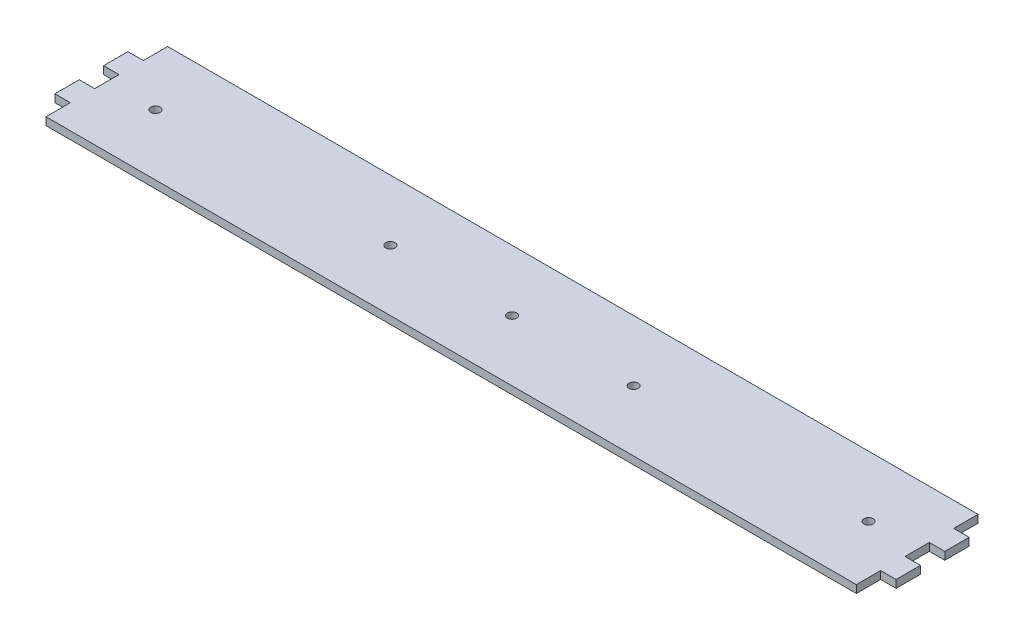
ISO-10303-21;
HEADER;
FILE_DESCRIPTION(('STEP AP214'),'2;1');
FILE_NAME('part.step','',(''),(''),'','','');
FILE_SCHEMA(('AUTOMOTIVE_DESIGN { 1 0 10303 214 1 1 1 1 }'));
ENDSEC;
DATA;
#1=APPLICATION_CONTEXT('core data for automotive mechanical design processes');
#2=APPLICATION_PROTOCOL_DEFINITION('international standard','automotive_design',2000,#1);
#3=PRODUCT_CONTEXT('',#1,'mechanical');
#4=PRODUCT('Part','Part','',(#3));
#5=PRODUCT_RELATED_PRODUCT_CATEGORY('part','',(#4));
#6=PRODUCT_DEFINITION_FORMATION('','',#4);
#7=PRODUCT_DEFINITION_CONTEXT('part definition',#1,'design');
#8=PRODUCT_DEFINITION('design','',#6,#7);
#9=PRODUCT_DEFINITION_SHAPE('','',#8);
#10=(LENGTH_UNIT() NAMED_UNIT(*) SI_UNIT(.MILLI.,.METRE.));
#11=(NAMED_UNIT(*) PLANE_ANGLE_UNIT() SI_UNIT($,.RADIAN.));
#12=(NAMED_UNIT(*) SI_UNIT($,.STERADIAN.) SOLID_ANGLE_UNIT());
#13=UNCERTAINTY_MEASURE_WITH_UNIT(LENGTH_MEASURE(1.E-05),#10,'distance_accuracy_value','');
#14=(GEOMETRIC_REPRESENTATION_CONTEXT(3) GLOBAL_UNCERTAINTY_ASSIGNED_CONTEXT((#13)) GLOBAL_UNIT_ASSIGNED_CONTEXT((#10,
#11,#12)) REPRESENTATION_CONTEXT('',''));
#15=CARTESIAN_POINT('',(0.,0.,0.));
#16=DIRECTION('',(0.,0.,1.));
#17=DIRECTION('',(1.,0.,0.));
#18=AXIS2_PLACEMENT_3D('',#15,#16,#17);
#19=CARTESIAN_POINT('',(0.,3.175,0.));
#20=DIRECTION('',(0.,-1.,0.));
#21=DIRECTION('',(0.,0.,-1.));
#22=AXIS2_PLACEMENT_3D('',#19,#20,#21);
#23=CYLINDRICAL_SURFACE('',#22,1.9);
#24=CARTESIAN_POINT('',(0.,3.175,0.));
#25=DIRECTION('',(0.,1.,0.));
#26=DIRECTION('',(0.,0.,1.));
#27=AXIS2_PLACEMENT_3D('',#24,#25,#26);
#28=CIRCLE('',#27,1.9);
#29=CARTESIAN_POINT('',(0.,3.175,1.89999999999998));
#30=VERTEX_POINT('',#29);
#31=EDGE_CURVE('E304',#30,#30,#28,.T.);
#32=ORIENTED_EDGE('',*,*,#31,.T.);
#33=EDGE_LOOP('',(#32));
#34=FACE_BOUND('',#33,.T.);
#35=CARTESIAN_POINT('',(0.,0.,0.));
#36=DIRECTION('',(0.,1.,0.));
#37=DIRECTION('',(0.,0.,1.));
#38=AXIS2_PLACEMENT_3D('',#35,#36,#37);
#39=CIRCLE('',#38,1.9);
#40=CARTESIAN_POINT('',(0.,0.,1.89999999999998));
#41=VERTEX_POINT('',#40);
#42=EDGE_CURVE('E353',#41,#41,#39,.T.);
#43=ORIENTED_EDGE('',*,*,#42,.F.);
#44=EDGE_LOOP('',(#43));
#45=FACE_BOUND('',#44,.T.);
#46=ADVANCED_FACE('F131',(#34,#45),#23,.F.);
#47=CARTESIAN_POINT('',(50.,3.175,0.));
#48=DIRECTION('',(0.,-1.,0.));
#49=DIRECTION('',(0.,0.,-1.));
#50=AXIS2_PLACEMENT_3D('',#47,#48,#49);
#51=CYLINDRICAL_SURFACE('',#50,1.9);
#52=CARTESIAN_POINT('',(50.,3.175,0.));
#53=DIRECTION('',(0.,1.,0.));
#54=DIRECTION('',(0.,0.,1.));
#55=AXIS2_PLACEMENT_3D('',#52,#53,#54);
#56=CIRCLE('',#55,1.9);
#57=CARTESIAN_POINT('',(50.,3.175,1.89999999999998));
#58=VERTEX_POINT('',#57);
#59=EDGE_CURVE('E308',#58,#58,#56,.T.);
#60=ORIENTED_EDGE('',*,*,#59,.T.);
#61=EDGE_LOOP('',(#60));
#62=FACE_BOUND('',#61,.T.);
#63=CARTESIAN_POINT('',(50.,0.,0.));
#64=DIRECTION('',(0.,1.,0.));
#65=DIRECTION('',(0.,0.,1.));
#66=AXIS2_PLACEMENT_3D('',#63,#64,#65);
#67=CIRCLE('',#66,1.9);
#68=CARTESIAN_POINT('',(50.,0.,1.89999999999998));
#69=VERTEX_POINT('',#68);
#70=EDGE_CURVE('E358',#69,#69,#67,.T.);
#71=ORIENTED_EDGE('',*,*,#70,.F.);
#72=EDGE_LOOP('',(#71));
#73=FACE_BOUND('',#72,.T.);
#74=ADVANCED_FACE('F630',(#62,#73),#51,.F.);
#75=CARTESIAN_POINT('',(-50.,3.175,3.28331452172592E-13));
#76=DIRECTION('',(0.,-1.,0.));
#77=DIRECTION('',(0.,0.,-1.));
#78=AXIS2_PLACEMENT_3D('',#75,#76,#77);
#79=CYLINDRICAL_SURFACE('',#78,1.9);
#80=CARTESIAN_POINT('',(-50.,3.175,3.28331452172592E-13));
#81=DIRECTION('',(0.,1.,0.));
#82=DIRECTION('',(0.,0.,1.));
#83=AXIS2_PLACEMENT_3D('',#80,#81,#82);
#84=CIRCLE('',#83,1.9);
#85=CARTESIAN_POINT('',(-50.,3.175,1.90000000000033));
#86=VERTEX_POINT('',#85);
#87=EDGE_CURVE('E311',#86,#86,#84,.T.);
#88=ORIENTED_EDGE('',*,*,#87,.T.);
#89=EDGE_LOOP('',(#88));
#90=FACE_BOUND('',#89,.T.);
#91=CARTESIAN_POINT('',(-50.,0.,3.28331452172592E-13));
#92=DIRECTION('',(0.,1.,0.));
#93=DIRECTION('',(0.,0.,1.));
#94=AXIS2_PLACEMENT_3D('',#91,#92,#93);
#95=CIRCLE('',#94,1.9);
#96=CARTESIAN_POINT('',(-50.,0.,1.90000000000033));
#97=VERTEX_POINT('',#96);
#98=EDGE_CURVE('E363',#97,#97,#95,.T.);
#99=ORIENTED_EDGE('',*,*,#98,.F.);
#100=EDGE_LOOP('',(#99));
#101=FACE_BOUND('',#100,.T.);
#102=ADVANCED_FACE('F634',(#90,#101),#79,.F.);
#103=CARTESIAN_POINT('',(146.5,3.175,0.));
#104=DIRECTION('',(0.,-1.,0.));
#105=DIRECTION('',(0.,0.,-1.));
#106=AXIS2_PLACEMENT_3D('',#103,#104,#105);
#107=CYLINDRICAL_SURFACE('',#106,1.9);
#108=CARTESIAN_POINT('',(146.5,3.175,0.));
#109=DIRECTION('',(0.,1.,0.));
#110=DIRECTION('',(0.,0.,1.));
#111=AXIS2_PLACEMENT_3D('',#108,#109,#110);
#112=CIRCLE('',#111,1.9);
#113=CARTESIAN_POINT('',(146.5,3.175,1.9));
#114=VERTEX_POINT('',#113);
#115=EDGE_CURVE('E314',#114,#114,#112,.T.);
#116=ORIENTED_EDGE('',*,*,#115,.T.);
#117=EDGE_LOOP('',(#116));
#118=FACE_BOUND('',#117,.T.);
#119=CARTESIAN_POINT('',(146.5,0.,0.));
#120=DIRECTION('',(0.,1.,0.));
#121=DIRECTION('',(0.,0.,1.));
#122=AXIS2_PLACEMENT_3D('',#119,#120,#121);
#123=CIRCLE('',#122,1.9);
#124=CARTESIAN_POINT('',(146.5,0.,1.9));
#125=VERTEX_POINT('',#124);
#126=EDGE_CURVE('E650',#125,#125,#123,.T.);
#127=ORIENTED_EDGE('',*,*,#126,.F.);
#128=EDGE_LOOP('',(#127));
#129=FACE_BOUND('',#128,.T.);
#130=ADVANCED_FACE('F638',(#118,#129),#107,.F.);
#131=CARTESIAN_POINT('',(-146.5,3.175,0.));
#132=DIRECTION('',(0.,-1.,0.));
#133=DIRECTION('',(0.,0.,-1.));
#134=AXIS2_PLACEMENT_3D('',#131,#132,#133);
#135=CYLINDRICAL_SURFACE('',#134,1.9);
#136=CARTESIAN_POINT('',(-146.5,3.175,0.));
#137=DIRECTION('',(0.,1.,0.));
#138=DIRECTION('',(0.,0.,1.));
#139=AXIS2_PLACEMENT_3D('',#136,#137,#138);
#140=CIRCLE('',#139,1.9);
#141=CARTESIAN_POINT('',(-146.5,3.175,1.9));
#142=VERTEX_POINT('',#141);
#143=EDGE_CURVE('E317',#142,#142,#140,.T.);
#144=ORIENTED_EDGE('',*,*,#143,.T.);
#145=EDGE_LOOP('',(#144));
#146=FACE_BOUND('',#145,.T.);
#147=CARTESIAN_POINT('',(-146.5,0.,0.));
#148=DIRECTION('',(0.,1.,0.));
#149=DIRECTION('',(0.,0.,1.));
#150=AXIS2_PLACEMENT_3D('',#147,#148,#149);
#151=CIRCLE('',#150,1.9);
#152=CARTESIAN_POINT('',(-146.5,0.,1.9));
#153=VERTEX_POINT('',#152);
#154=EDGE_CURVE('E491',#153,#153,#151,.T.);
#155=ORIENTED_EDGE('',*,*,#154,.F.);
#156=EDGE_LOOP('',(#155));
#157=FACE_BOUND('',#156,.T.);
#158=ADVANCED_FACE('F525',(#146,#157),#135,.F.);
#159=CARTESIAN_POINT('',(0.,3.175,-4.99999999999999));
#160=DIRECTION('',(0.,0.,-1.));
#161=DIRECTION('',(-1.,0.,0.));
#162=AXIS2_PLACEMENT_3D('',#159,#160,#161);
#163=PLANE('',#162);
#164=DIRECTION('',(1.,0.,0.));
#165=VECTOR('',#164,1.);
#166=CARTESIAN_POINT('',(0.,0.,-4.99999999999999));
#167=LINE('',#166,#165);
#168=CARTESIAN_POINT('',(-172.85,0.,-5.00000000000002));
#169=VERTEX_POINT('',#168);
#170=CARTESIAN_POINT('',(-166.5,0.,-5.00000000000002));
#171=VERTEX_POINT('',#170);
#172=EDGE_CURVE('E301',#169,#171,#167,.T.);
#173=ORIENTED_EDGE('',*,*,#172,.T.);
#174=DIRECTION('',(0.,-1.,0.));
#175=VECTOR('',#174,1.);
#176=CARTESIAN_POINT('',(-166.5,3.175,-5.00000000000002));
#177=LINE('',#176,#175);
#178=CARTESIAN_POINT('',(-166.5,3.175,-5.00000000000002));
#179=VERTEX_POINT('',#178);
#180=EDGE_CURVE('E217',#179,#171,#177,.T.);
#181=ORIENTED_EDGE('',*,*,#180,.F.);
#182=DIRECTION('',(1.,0.,0.));
#183=VECTOR('',#182,1.);
#184=CARTESIAN_POINT('',(0.,3.175,-4.99999999999999));
#185=LINE('',#184,#183);
#186=CARTESIAN_POINT('',(-172.85,3.175,-5.00000000000002));
#187=VERTEX_POINT('',#186);
#188=EDGE_CURVE('E348',#187,#179,#185,.T.);
#189=ORIENTED_EDGE('',*,*,#188,.F.);
#190=DIRECTION('',(0.,-1.,0.));
#191=VECTOR('',#190,1.);
#192=CARTESIAN_POINT('',(-172.85,3.175,-5.00000000000002));
#193=LINE('',#192,#191);
#194=EDGE_CURVE('E213',#187,#169,#193,.T.);
#195=ORIENTED_EDGE('',*,*,#194,.T.);
#196=EDGE_LOOP('',(#173,#181,#189,#195));
#197=FACE_BOUND('',#196,.T.);
#198=ADVANCED_FACE('F473',(#197),#163,.F.);
#199=CARTESIAN_POINT('',(-166.5,3.175,0.));
#200=DIRECTION('',(-1.,0.,0.));
#201=DIRECTION('',(0.,0.,1.));
#202=AXIS2_PLACEMENT_3D('',#199,#200,#201);
#203=PLANE('',#202);
#204=DIRECTION('',(0.,-1.,0.));
#205=VECTOR('',#204,1.);
#206=CARTESIAN_POINT('',(-166.5,3.175,4.99999999999998));
#207=LINE('',#206,#205);
#208=CARTESIAN_POINT('',(-166.5,3.175,4.99999999999998));
#209=VERTEX_POINT('',#208);
#210=CARTESIAN_POINT('',(-166.5,0.,4.99999999999998));
#211=VERTEX_POINT('',#210);
#212=EDGE_CURVE('E12',#209,#211,#207,.T.);
#213=ORIENTED_EDGE('',*,*,#212,.F.);
#214=DIRECTION('',(0.,0.,-1.));
#215=VECTOR('',#214,1.);
#216=CARTESIAN_POINT('',(-166.5,3.175,0.));
#217=LINE('',#216,#215);
#218=EDGE_CURVE('E347',#209,#179,#217,.T.);
#219=ORIENTED_EDGE('',*,*,#218,.T.);
#220=ORIENTED_EDGE('',*,*,#180,.T.);
#221=DIRECTION('',(0.,0.,-1.));
#222=VECTOR('',#221,1.);
#223=CARTESIAN_POINT('',(-166.5,0.,0.));
#224=LINE('',#223,#222);
#225=EDGE_CURVE('E298',#211,#171,#224,.T.);
#226=ORIENTED_EDGE('',*,*,#225,.F.);
#227=EDGE_LOOP('',(#213,#219,#220,#226));
#228=FACE_BOUND('',#227,.T.);
#229=ADVANCED_FACE('F424',(#228),#203,.T.);
#230=CARTESIAN_POINT('',(-166.5,3.175,25.));
#231=VERTEX_POINT('',#230);
#232=CARTESIAN_POINT('',(-166.5,3.175,15.));
#233=VERTEX_POINT('',#232);
#234=EDGE_CURVE('E344',#231,#233,#217,.T.);
#235=ORIENTED_EDGE('',*,*,#234,.T.);
#236=DIRECTION('',(0.,-1.,0.));
#237=VECTOR('',#236,1.);
#238=CARTESIAN_POINT('',(-166.5,3.175,15.));
#239=LINE('',#238,#237);
#240=CARTESIAN_POINT('',(-166.5,0.,15.));
#241=VERTEX_POINT('',#240);
#242=EDGE_CURVE('E141',#233,#241,#239,.T.);
#243=ORIENTED_EDGE('',*,*,#242,.T.);
#244=CARTESIAN_POINT('',(-166.5,0.,25.));
#245=VERTEX_POINT('',#244);
#246=EDGE_CURVE('E291',#245,#241,#224,.T.);
#247=ORIENTED_EDGE('',*,*,#246,.F.);
#248=DIRECTION('',(0.,-1.,0.));
#249=VECTOR('',#248,1.);
#250=CARTESIAN_POINT('',(-166.5,3.175,25.));
#251=LINE('',#250,#249);
#252=EDGE_CURVE('E225',#231,#245,#251,.T.);
#253=ORIENTED_EDGE('',*,*,#252,.F.);
#254=EDGE_LOOP('',(#235,#243,#247,#253));
#255=FACE_BOUND('',#254,.T.);
#256=ADVANCED_FACE('F401',(#255),#203,.T.);
#257=CARTESIAN_POINT('',(0.,3.175,25.));
#258=DIRECTION('',(0.,0.,-1.));
#259=DIRECTION('',(-1.,0.,0.));
#260=AXIS2_PLACEMENT_3D('',#257,#258,#259);
#261=PLANE('',#260);
#262=DIRECTION('',(1.,0.,0.));
#263=VECTOR('',#262,1.);
#264=CARTESIAN_POINT('',(0.,0.,25.));
#265=LINE('',#264,#263);
#266=CARTESIAN_POINT('',(166.5,0.,25.));
#267=VERTEX_POINT('',#266);
#268=EDGE_CURVE('E281',#245,#267,#265,.T.);
#269=ORIENTED_EDGE('',*,*,#268,.T.);
#270=DIRECTION('',(0.,-1.,0.));
#271=VECTOR('',#270,1.);
#272=CARTESIAN_POINT('',(166.5,3.175,25.));
#273=LINE('',#272,#271);
#274=CARTESIAN_POINT('',(166.5,3.175,25.));
#275=VERTEX_POINT('',#274);
#276=EDGE_CURVE('E387',#275,#267,#273,.T.);
#277=ORIENTED_EDGE('',*,*,#276,.F.);
#278=DIRECTION('',(1.,0.,0.));
#279=VECTOR('',#278,1.);
#280=CARTESIAN_POINT('',(0.,3.175,25.));
#281=LINE('',#280,#279);
#282=EDGE_CURVE('E341',#231,#275,#281,.T.);
#283=ORIENTED_EDGE('',*,*,#282,.F.);
#284=ORIENTED_EDGE('',*,*,#252,.T.);
#285=EDGE_LOOP('',(#269,#277,#283,#284));
#286=FACE_BOUND('',#285,.T.);
#287=ADVANCED_FACE('F391',(#286),#261,.F.);
#288=CARTESIAN_POINT('',(166.5,3.175,0.));
#289=DIRECTION('',(-1.,0.,0.));
#290=DIRECTION('',(0.,0.,1.));
#291=AXIS2_PLACEMENT_3D('',#288,#289,#290);
#292=PLANE('',#291);
#293=DIRECTION('',(0.,0.,-1.));
#294=VECTOR('',#293,1.);
#295=CARTESIAN_POINT('',(166.5,0.,0.));
#296=LINE('',#295,#294);
#297=CARTESIAN_POINT('',(166.5,0.,15.));
#298=VERTEX_POINT('',#297);
#299=EDGE_CURVE('E273',#267,#298,#296,.T.);
#300=ORIENTED_EDGE('',*,*,#299,.T.);
#301=DIRECTION('',(0.,-1.,0.));
#302=VECTOR('',#301,1.);
#303=CARTESIAN_POINT('',(166.5,3.175,15.));
#304=LINE('',#303,#302);
#305=CARTESIAN_POINT('',(166.5,3.175,15.));
#306=VERTEX_POINT('',#305);
#307=EDGE_CURVE('E385',#306,#298,#304,.T.);
#308=ORIENTED_EDGE('',*,*,#307,.F.);
#309=DIRECTION('',(0.,0.,-1.));
#310=VECTOR('',#309,1.);
#311=CARTESIAN_POINT('',(166.5,3.175,0.));
#312=LINE('',#311,#310);
#313=EDGE_CURVE('E338',#275,#306,#312,.T.);
#314=ORIENTED_EDGE('',*,*,#313,.F.);
#315=ORIENTED_EDGE('',*,*,#276,.T.);
#316=EDGE_LOOP('',(#300,#308,#314,#315));
#317=FACE_BOUND('',#316,.T.);
#318=ADVANCED_FACE('F528',(#317),#292,.F.);
#319=CARTESIAN_POINT('',(0.,3.175,14.9999999999999));
#320=DIRECTION('',(0.,0.,-1.));
#321=DIRECTION('',(-1.,0.,0.));
#322=AXIS2_PLACEMENT_3D('',#319,#320,#321);
#323=PLANE('',#322);
#324=DIRECTION('',(1.,0.,0.));
#325=VECTOR('',#324,1.);
#326=CARTESIAN_POINT('',(0.,0.,14.9999999999999));
#327=LINE('',#326,#325);
#328=CARTESIAN_POINT('',(172.85,0.,15.));
#329=VERTEX_POINT('',#328);
#330=EDGE_CURVE('E280',#298,#329,#327,.T.);
#331=ORIENTED_EDGE('',*,*,#330,.T.);
#332=DIRECTION('',(0.,-1.,0.));
#333=VECTOR('',#332,1.);
#334=CARTESIAN_POINT('',(172.85,3.175,15.));
#335=LINE('',#334,#333);
#336=CARTESIAN_POINT('',(172.85,3.175,15.));
#337=VERTEX_POINT('',#336);
#338=EDGE_CURVE('E382',#337,#329,#335,.T.);
#339=ORIENTED_EDGE('',*,*,#338,.F.);
#340=DIRECTION('',(1.,0.,0.));
#341=VECTOR('',#340,1.);
#342=CARTESIAN_POINT('',(0.,3.175,14.9999999999999));
#343=LINE('',#342,#341);
#344=EDGE_CURVE('E335',#306,#337,#343,.T.);
#345=ORIENTED_EDGE('',*,*,#344,.F.);
#346=ORIENTED_EDGE('',*,*,#307,.T.);
#347=EDGE_LOOP('',(#331,#339,#345,#346));
#348=FACE_BOUND('',#347,.T.);
#349=ADVANCED_FACE('F529',(#348),#323,.F.);
#350=CARTESIAN_POINT('',(172.85,3.175,0.));
#351=DIRECTION('',(-1.,0.,0.));
#352=DIRECTION('',(0.,0.,1.));
#353=AXIS2_PLACEMENT_3D('',#350,#351,#352);
#354=PLANE('',#353);
#355=DIRECTION('',(0.,0.,-1.));
#356=VECTOR('',#355,1.);
#357=CARTESIAN_POINT('',(172.85,0.,0.));
#358=LINE('',#357,#356);
#359=CARTESIAN_POINT('',(172.85,0.,4.99999999999998));
#360=VERTEX_POINT('',#359);
#361=EDGE_CURVE('E289',#329,#360,#358,.T.);
#362=ORIENTED_EDGE('',*,*,#361,.T.);
#363=DIRECTION('',(0.,-1.,0.));
#364=VECTOR('',#363,1.);
#365=CARTESIAN_POINT('',(172.85,3.175,4.99999999999998));
#366=LINE('',#365,#364);
#367=CARTESIAN_POINT('',(172.85,3.175,4.99999999999998));
#368=VERTEX_POINT('',#367);
#369=EDGE_CURVE('E379',#368,#360,#366,.T.);
#370=ORIENTED_EDGE('',*,*,#369,.F.);
#371=DIRECTION('',(0.,0.,-1.));
#372=VECTOR('',#371,1.);
#373=CARTESIAN_POINT('',(172.85,3.175,0.));
#374=LINE('',#373,#372);
#375=EDGE_CURVE('E332',#337,#368,#374,.T.);
#376=ORIENTED_EDGE('',*,*,#375,.F.);
#377=ORIENTED_EDGE('',*,*,#338,.T.);
#378=EDGE_LOOP('',(#362,#370,#376,#377));
#379=FACE_BOUND('',#378,.T.);
#380=ADVANCED_FACE('F532',(#379),#354,.F.);
#381=CARTESIAN_POINT('',(0.,3.175,4.99999999999998));
#382=DIRECTION('',(0.,0.,1.));
#383=DIRECTION('',(1.,0.,0.));
#384=AXIS2_PLACEMENT_3D('',#381,#382,#383);
#385=PLANE('',#384);
#386=DIRECTION('',(-1.,0.,0.));
#387=VECTOR('',#386,1.);
#388=CARTESIAN_POINT('',(0.,0.,4.99999999999998));
#389=LINE('',#388,#387);
#390=CARTESIAN_POINT('',(166.5,0.,4.99999999999998));
#391=VERTEX_POINT('',#390);
#392=EDGE_CURVE('E276',#360,#391,#389,.T.);
#393=ORIENTED_EDGE('',*,*,#392,.T.);
#394=DIRECTION('',(0.,-1.,0.));
#395=VECTOR('',#394,1.);
#396=CARTESIAN_POINT('',(166.5,3.175,4.99999999999998));
#397=LINE('',#396,#395);
#398=CARTESIAN_POINT('',(166.5,3.175,4.99999999999998));
#399=VERTEX_POINT('',#398);
#400=EDGE_CURVE('E270',#399,#391,#397,.T.);
#401=ORIENTED_EDGE('',*,*,#400,.F.);
#402=DIRECTION('',(-1.,0.,0.));
#403=VECTOR('',#402,1.);
#404=CARTESIAN_POINT('',(0.,3.175,4.99999999999998));
#405=LINE('',#404,#403);
#406=EDGE_CURVE('E328',#368,#399,#405,.T.);
#407=ORIENTED_EDGE('',*,*,#406,.F.);
#408=ORIENTED_EDGE('',*,*,#369,.T.);
#409=EDGE_LOOP('',(#393,#401,#407,#408));
#410=FACE_BOUND('',#409,.T.);
#411=ADVANCED_FACE('F536',(#410),#385,.F.);
#412=DIRECTION('',(0.,-1.,0.));
#413=VECTOR('',#412,1.);
#414=CARTESIAN_POINT('',(166.5,3.175,-5.00000000000002));
#415=LINE('',#414,#413);
#416=CARTESIAN_POINT('',(166.5,3.175,-5.00000000000002));
#417=VERTEX_POINT('',#416);
#418=CARTESIAN_POINT('',(166.5,0.,-5.00000000000002));
#419=VERTEX_POINT('',#418);
#420=EDGE_CURVE('E210',#417,#419,#415,.T.);
#421=ORIENTED_EDGE('',*,*,#420,.F.);
#422=EDGE_CURVE('E327',#399,#417,#312,.T.);
#423=ORIENTED_EDGE('',*,*,#422,.F.);
#424=ORIENTED_EDGE('',*,*,#400,.T.);
#425=EDGE_CURVE('E262',#391,#419,#296,.T.);
#426=ORIENTED_EDGE('',*,*,#425,.T.);
#427=EDGE_LOOP('',(#421,#423,#424,#426));
#428=FACE_BOUND('',#427,.T.);
#429=ADVANCED_FACE('F267',(#428),#292,.F.);
#430=CARTESIAN_POINT('',(166.5,3.175,-15.));
#431=VERTEX_POINT('',#430);
#432=CARTESIAN_POINT('',(166.5,3.175,-25.));
#433=VERTEX_POINT('',#432);
#434=EDGE_CURVE('E331',#431,#433,#312,.T.);
#435=ORIENTED_EDGE('',*,*,#434,.F.);
#436=DIRECTION('',(0.,-1.,0.));
#437=VECTOR('',#436,1.);
#438=CARTESIAN_POINT('',(166.5,3.175,-15.));
#439=LINE('',#438,#437);
#440=CARTESIAN_POINT('',(166.5,0.,-15.));
#441=VERTEX_POINT('',#440);
#442=EDGE_CURVE('E150',#431,#441,#439,.T.);
#443=ORIENTED_EDGE('',*,*,#442,.T.);
#444=CARTESIAN_POINT('',(166.5,0.,-25.));
#445=VERTEX_POINT('',#444);
#446=EDGE_CURVE('E202',#441,#445,#296,.T.);
#447=ORIENTED_EDGE('',*,*,#446,.T.);
#448=DIRECTION('',(0.,-1.,0.));
#449=VECTOR('',#448,1.);
#450=CARTESIAN_POINT('',(166.5,3.175,-25.));
#451=LINE('',#450,#449);
#452=EDGE_CURVE('E375',#433,#445,#451,.T.);
#453=ORIENTED_EDGE('',*,*,#452,.F.);
#454=EDGE_LOOP('',(#435,#443,#447,#453));
#455=FACE_BOUND('',#454,.T.);
#456=ADVANCED_FACE('F541',(#455),#292,.F.);
#457=CARTESIAN_POINT('',(0.,3.175,-25.));
#458=DIRECTION('',(0.,0.,-1.));
#459=DIRECTION('',(-1.,0.,0.));
#460=AXIS2_PLACEMENT_3D('',#457,#458,#459);
#461=PLANE('',#460);
#462=DIRECTION('',(1.,0.,0.));
#463=VECTOR('',#462,1.);
#464=CARTESIAN_POINT('',(0.,0.,-25.));
#465=LINE('',#464,#463);
#466=CARTESIAN_POINT('',(-166.5,0.,-25.));
#467=VERTEX_POINT('',#466);
#468=EDGE_CURVE('E271',#467,#445,#465,.T.);
#469=ORIENTED_EDGE('',*,*,#468,.F.);
#470=DIRECTION('',(0.,-1.,0.));
#471=VECTOR('',#470,1.);
#472=CARTESIAN_POINT('',(-166.5,3.175,-25.));
#473=LINE('',#472,#471);
#474=CARTESIAN_POINT('',(-166.5,3.175,-25.));
#475=VERTEX_POINT('',#474);
#476=EDGE_CURVE('E372',#475,#467,#473,.T.);
#477=ORIENTED_EDGE('',*,*,#476,.F.);
#478=DIRECTION('',(1.,0.,0.));
#479=VECTOR('',#478,1.);
#480=CARTESIAN_POINT('',(0.,3.175,-25.));
#481=LINE('',#480,#479);
#482=EDGE_CURVE('E324',#475,#433,#481,.T.);
#483=ORIENTED_EDGE('',*,*,#482,.T.);
#484=ORIENTED_EDGE('',*,*,#452,.T.);
#485=EDGE_LOOP('',(#469,#477,#483,#484));
#486=FACE_BOUND('',#485,.T.);
#487=ADVANCED_FACE('F487',(#486),#461,.T.);
#488=CARTESIAN_POINT('',(-166.5,0.,-15.));
#489=VERTEX_POINT('',#488);
#490=EDGE_CURVE('E274',#489,#467,#224,.T.);
#491=ORIENTED_EDGE('',*,*,#490,.F.);
#492=DIRECTION('',(0.,-1.,0.));
#493=VECTOR('',#492,1.);
#494=CARTESIAN_POINT('',(-166.5,3.175,-15.));
#495=LINE('',#494,#493);
#496=CARTESIAN_POINT('',(-166.5,3.175,-15.));
#497=VERTEX_POINT('',#496);
#498=EDGE_CURVE('E369',#497,#489,#495,.T.);
#499=ORIENTED_EDGE('',*,*,#498,.F.);
#500=EDGE_CURVE('E323',#497,#475,#217,.T.);
#501=ORIENTED_EDGE('',*,*,#500,.T.);
#502=ORIENTED_EDGE('',*,*,#476,.T.);
#503=EDGE_LOOP('',(#491,#499,#501,#502));
#504=FACE_BOUND('',#503,.T.);
#505=ADVANCED_FACE('F480',(#504),#203,.T.);
#506=CARTESIAN_POINT('',(0.,3.175,-15.));
#507=DIRECTION('',(0.,0.,1.));
#508=DIRECTION('',(1.,0.,0.));
#509=AXIS2_PLACEMENT_3D('',#506,#507,#508);
#510=PLANE('',#509);
#511=DIRECTION('',(-1.,0.,0.));
#512=VECTOR('',#511,1.);
#513=CARTESIAN_POINT('',(0.,0.,-15.));
#514=LINE('',#513,#512);
#515=CARTESIAN_POINT('',(-172.85,0.,-15.));
#516=VERTEX_POINT('',#515);
#517=EDGE_CURVE('E490',#489,#516,#514,.T.);
#518=ORIENTED_EDGE('',*,*,#517,.T.);
#519=DIRECTION('',(0.,-1.,0.));
#520=VECTOR('',#519,1.);
#521=CARTESIAN_POINT('',(-172.85,3.175,-15.));
#522=LINE('',#521,#520);
#523=CARTESIAN_POINT('',(-172.85,3.175,-15.));
#524=VERTEX_POINT('',#523);
#525=EDGE_CURVE('E307',#524,#516,#522,.T.);
#526=ORIENTED_EDGE('',*,*,#525,.F.);
#527=DIRECTION('',(-1.,0.,0.));
#528=VECTOR('',#527,1.);
#529=CARTESIAN_POINT('',(0.,3.175,-15.));
#530=LINE('',#529,#528);
#531=EDGE_CURVE('E320',#497,#524,#530,.T.);
#532=ORIENTED_EDGE('',*,*,#531,.F.);
#533=ORIENTED_EDGE('',*,*,#498,.T.);
#534=EDGE_LOOP('',(#518,#526,#532,#533));
#535=FACE_BOUND('',#534,.T.);
#536=ADVANCED_FACE('F496',(#535),#510,.F.);
#537=CARTESIAN_POINT('',(-172.85,3.175,0.));
#538=DIRECTION('',(1.,0.,0.));
#539=DIRECTION('',(0.,0.,-1.));
#540=AXIS2_PLACEMENT_3D('',#537,#538,#539);
#541=PLANE('',#540);
#542=DIRECTION('',(0.,0.,1.));
#543=VECTOR('',#542,1.);
#544=CARTESIAN_POINT('',(-172.85,0.,0.));
#545=LINE('',#544,#543);
#546=EDGE_CURVE('E252',#516,#169,#545,.T.);
#547=ORIENTED_EDGE('',*,*,#546,.T.);
#548=ORIENTED_EDGE('',*,*,#194,.F.);
#549=DIRECTION('',(0.,0.,1.));
#550=VECTOR('',#549,1.);
#551=CARTESIAN_POINT('',(-172.85,3.175,0.));
#552=LINE('',#551,#550);
#553=EDGE_CURVE('E351',#524,#187,#552,.T.);
#554=ORIENTED_EDGE('',*,*,#553,.F.);
#555=ORIENTED_EDGE('',*,*,#525,.T.);
#556=EDGE_LOOP('',(#547,#548,#554,#555));
#557=FACE_BOUND('',#556,.T.);
#558=ADVANCED_FACE('F494',(#557),#541,.F.);
#559=CARTESIAN_POINT('',(0.,0.,0.));
#560=DIRECTION('',(0.,1.,0.));
#561=DIRECTION('',(0.,0.,1.));
#562=AXIS2_PLACEMENT_3D('',#559,#560,#561);
#563=PLANE('',#562);
#564=ORIENTED_EDGE('',*,*,#546,.F.);
#565=ORIENTED_EDGE('',*,*,#517,.F.);
#566=ORIENTED_EDGE('',*,*,#490,.T.);
#567=ORIENTED_EDGE('',*,*,#468,.T.);
#568=ORIENTED_EDGE('',*,*,#446,.F.);
#569=DIRECTION('',(-1.,0.,0.));
#570=VECTOR('',#569,1.);
#571=CARTESIAN_POINT('',(172.85,0.,-15.));
#572=LINE('',#571,#570);
#573=CARTESIAN_POINT('',(172.85,0.,-15.));
#574=VERTEX_POINT('',#573);
#575=EDGE_CURVE('E190',#574,#441,#572,.T.);
#576=ORIENTED_EDGE('',*,*,#575,.F.);
#577=DIRECTION('',(0.,0.,-1.));
#578=VECTOR('',#577,1.);
#579=CARTESIAN_POINT('',(172.85,0.,-5.00000000000002));
#580=LINE('',#579,#578);
#581=CARTESIAN_POINT('',(172.85,0.,-5.00000000000002));
#582=VERTEX_POINT('',#581);
#583=EDGE_CURVE('E181',#582,#574,#580,.T.);
#584=ORIENTED_EDGE('',*,*,#583,.F.);
#585=DIRECTION('',(1.,0.,0.));
#586=VECTOR('',#585,1.);
#587=CARTESIAN_POINT('',(166.5,0.,-5.00000000000002));
#588=LINE('',#587,#586);
#589=EDGE_CURVE('E191',#419,#582,#588,.T.);
#590=ORIENTED_EDGE('',*,*,#589,.F.);
#591=ORIENTED_EDGE('',*,*,#425,.F.);
#592=ORIENTED_EDGE('',*,*,#392,.F.);
#593=ORIENTED_EDGE('',*,*,#361,.F.);
#594=ORIENTED_EDGE('',*,*,#330,.F.);
#595=ORIENTED_EDGE('',*,*,#299,.F.);
#596=ORIENTED_EDGE('',*,*,#268,.F.);
#597=ORIENTED_EDGE('',*,*,#246,.T.);
#598=DIRECTION('',(1.,0.,0.));
#599=VECTOR('',#598,1.);
#600=CARTESIAN_POINT('',(-172.85,0.,15.));
#601=LINE('',#600,#599);
#602=CARTESIAN_POINT('',(-172.85,0.,15.));
#603=VERTEX_POINT('',#602);
#604=EDGE_CURVE('E233',#603,#241,#601,.T.);
#605=ORIENTED_EDGE('',*,*,#604,.F.);
#606=DIRECTION('',(0.,0.,1.));
#607=VECTOR('',#606,1.);
#608=CARTESIAN_POINT('',(-172.85,0.,4.99999999999998));
#609=LINE('',#608,#607);
#610=CARTESIAN_POINT('',(-172.85,0.,4.99999999999998));
#611=VERTEX_POINT('',#610);
#612=EDGE_CURVE('E242',#611,#603,#609,.T.);
#613=ORIENTED_EDGE('',*,*,#612,.F.);
#614=DIRECTION('',(-1.,0.,0.));
#615=VECTOR('',#614,1.);
#616=CARTESIAN_POINT('',(-166.5,0.,4.99999999999998));
#617=LINE('',#616,#615);
#618=EDGE_CURVE('E239',#211,#611,#617,.T.);
#619=ORIENTED_EDGE('',*,*,#618,.F.);
#620=ORIENTED_EDGE('',*,*,#225,.T.);
#621=ORIENTED_EDGE('',*,*,#172,.F.);
#622=EDGE_LOOP('',(#564,#565,#566,#567,#568,#576,#584,#590,#591,#592,#593,#594,#595,#596,#597,
#605,#613,#619,#620,#621));
#623=FACE_BOUND('',#622,.T.);
#624=ORIENTED_EDGE('',*,*,#154,.T.);
#625=EDGE_LOOP('',(#624));
#626=FACE_BOUND('',#625,.T.);
#627=ORIENTED_EDGE('',*,*,#126,.T.);
#628=EDGE_LOOP('',(#627));
#629=FACE_BOUND('',#628,.T.);
#630=ORIENTED_EDGE('',*,*,#98,.T.);
#631=EDGE_LOOP('',(#630));
#632=FACE_BOUND('',#631,.T.);
#633=ORIENTED_EDGE('',*,*,#70,.T.);
#634=EDGE_LOOP('',(#633));
#635=FACE_BOUND('',#634,.T.);
#636=ORIENTED_EDGE('',*,*,#42,.T.);
#637=EDGE_LOOP('',(#636));
#638=FACE_BOUND('',#637,.T.);
#639=ADVANCED_FACE('F198',(#623,#626,#629,#632,#635,#638),#563,.F.);
#640=CARTESIAN_POINT('',(0.,3.175,0.));
#641=DIRECTION('',(0.,1.,0.));
#642=DIRECTION('',(0.,0.,1.));
#643=AXIS2_PLACEMENT_3D('',#640,#641,#642);
#644=PLANE('',#643);
#645=ORIENTED_EDGE('',*,*,#553,.T.);
#646=ORIENTED_EDGE('',*,*,#188,.T.);
#647=ORIENTED_EDGE('',*,*,#218,.F.);
#648=DIRECTION('',(-1.,0.,0.));
#649=VECTOR('',#648,1.);
#650=CARTESIAN_POINT('',(-166.5,3.175,4.99999999999998));
#651=LINE('',#650,#649);
#652=CARTESIAN_POINT('',(-172.85,3.175,4.99999999999998));
#653=VERTEX_POINT('',#652);
#654=EDGE_CURVE('E229',#209,#653,#651,.T.);
#655=ORIENTED_EDGE('',*,*,#654,.T.);
#656=DIRECTION('',(0.,0.,1.));
#657=VECTOR('',#656,1.);
#658=CARTESIAN_POINT('',(-172.85,3.175,4.99999999999998));
#659=LINE('',#658,#657);
#660=CARTESIAN_POINT('',(-172.85,3.175,15.));
#661=VERTEX_POINT('',#660);
#662=EDGE_CURVE('E232',#653,#661,#659,.T.);
#663=ORIENTED_EDGE('',*,*,#662,.T.);
#664=DIRECTION('',(1.,0.,0.));
#665=VECTOR('',#664,1.);
#666=CARTESIAN_POINT('',(-172.85,3.175,15.));
#667=LINE('',#666,#665);
#668=EDGE_CURVE('E235',#661,#233,#667,.T.);
#669=ORIENTED_EDGE('',*,*,#668,.T.);
#670=ORIENTED_EDGE('',*,*,#234,.F.);
#671=ORIENTED_EDGE('',*,*,#282,.T.);
#672=ORIENTED_EDGE('',*,*,#313,.T.);
#673=ORIENTED_EDGE('',*,*,#344,.T.);
#674=ORIENTED_EDGE('',*,*,#375,.T.);
#675=ORIENTED_EDGE('',*,*,#406,.T.);
#676=ORIENTED_EDGE('',*,*,#422,.T.);
#677=DIRECTION('',(1.,0.,0.));
#678=VECTOR('',#677,1.);
#679=CARTESIAN_POINT('',(166.5,3.175,-5.00000000000002));
#680=LINE('',#679,#678);
#681=CARTESIAN_POINT('',(172.85,3.175,-5.00000000000002));
#682=VERTEX_POINT('',#681);
#683=EDGE_CURVE('E203',#417,#682,#680,.T.);
#684=ORIENTED_EDGE('',*,*,#683,.T.);
#685=DIRECTION('',(0.,0.,-1.));
#686=VECTOR('',#685,1.);
#687=CARTESIAN_POINT('',(172.85,3.175,-5.00000000000002));
#688=LINE('',#687,#686);
#689=CARTESIAN_POINT('',(172.85,3.175,-15.));
#690=VERTEX_POINT('',#689);
#691=EDGE_CURVE('E206',#682,#690,#688,.T.);
#692=ORIENTED_EDGE('',*,*,#691,.T.);
#693=DIRECTION('',(-1.,0.,0.));
#694=VECTOR('',#693,1.);
#695=CARTESIAN_POINT('',(172.85,3.175,-15.));
#696=LINE('',#695,#694);
#697=EDGE_CURVE('E196',#690,#431,#696,.T.);
#698=ORIENTED_EDGE('',*,*,#697,.T.);
#699=ORIENTED_EDGE('',*,*,#434,.T.);
#700=ORIENTED_EDGE('',*,*,#482,.F.);
#701=ORIENTED_EDGE('',*,*,#500,.F.);
#702=ORIENTED_EDGE('',*,*,#531,.T.);
#703=EDGE_LOOP('',(#645,#646,#647,#655,#663,#669,#670,#671,#672,#673,#674,#675,#676,#684,#692,
#698,#699,#700,#701,#702));
#704=FACE_BOUND('',#703,.T.);
#705=ORIENTED_EDGE('',*,*,#143,.F.);
#706=EDGE_LOOP('',(#705));
#707=FACE_BOUND('',#706,.T.);
#708=ORIENTED_EDGE('',*,*,#115,.F.);
#709=EDGE_LOOP('',(#708));
#710=FACE_BOUND('',#709,.T.);
#711=ORIENTED_EDGE('',*,*,#87,.F.);
#712=EDGE_LOOP('',(#711));
#713=FACE_BOUND('',#712,.T.);
#714=ORIENTED_EDGE('',*,*,#59,.F.);
#715=EDGE_LOOP('',(#714));
#716=FACE_BOUND('',#715,.T.);
#717=ORIENTED_EDGE('',*,*,#31,.F.);
#718=EDGE_LOOP('',(#717));
#719=FACE_BOUND('',#718,.T.);
#720=ADVANCED_FACE('F474',(#704,#707,#710,#713,#716,#719),#644,.T.);
#721=CARTESIAN_POINT('',(172.85,3.175,-5.00000000000002));
#722=DIRECTION('',(-1.,0.,0.));
#723=DIRECTION('',(0.,0.,1.));
#724=AXIS2_PLACEMENT_3D('',#721,#722,#723);
#725=PLANE('',#724);
#726=ORIENTED_EDGE('',*,*,#583,.T.);
#727=DIRECTION('',(0.,-1.,0.));
#728=VECTOR('',#727,1.);
#729=CARTESIAN_POINT('',(172.85,3.175,-15.));
#730=LINE('',#729,#728);
#731=EDGE_CURVE('E187',#690,#574,#730,.T.);
#732=ORIENTED_EDGE('',*,*,#731,.F.);
#733=ORIENTED_EDGE('',*,*,#691,.F.);
#734=DIRECTION('',(0.,-1.,0.));
#735=VECTOR('',#734,1.);
#736=CARTESIAN_POINT('',(172.85,3.175,-5.00000000000002));
#737=LINE('',#736,#735);
#738=EDGE_CURVE('E135',#682,#582,#737,.T.);
#739=ORIENTED_EDGE('',*,*,#738,.T.);
#740=EDGE_LOOP('',(#726,#732,#733,#739));
#741=FACE_BOUND('',#740,.T.);
#742=ADVANCED_FACE('F186',(#741),#725,.F.);
#743=CARTESIAN_POINT('',(172.85,3.175,-15.));
#744=DIRECTION('',(0.,0.,1.));
#745=DIRECTION('',(1.,0.,0.));
#746=AXIS2_PLACEMENT_3D('',#743,#744,#745);
#747=PLANE('',#746);
#748=ORIENTED_EDGE('',*,*,#575,.T.);
#749=ORIENTED_EDGE('',*,*,#442,.F.);
#750=ORIENTED_EDGE('',*,*,#697,.F.);
#751=ORIENTED_EDGE('',*,*,#731,.T.);
#752=EDGE_LOOP('',(#748,#749,#750,#751));
#753=FACE_BOUND('',#752,.T.);
#754=ADVANCED_FACE('F193',(#753),#747,.F.);
#755=CARTESIAN_POINT('',(166.5,3.175,-5.00000000000002));
#756=DIRECTION('',(0.,0.,-1.));
#757=DIRECTION('',(-1.,0.,0.));
#758=AXIS2_PLACEMENT_3D('',#755,#756,#757);
#759=PLANE('',#758);
#760=ORIENTED_EDGE('',*,*,#589,.T.);
#761=ORIENTED_EDGE('',*,*,#738,.F.);
#762=ORIENTED_EDGE('',*,*,#683,.F.);
#763=ORIENTED_EDGE('',*,*,#420,.T.);
#764=EDGE_LOOP('',(#760,#761,#762,#763));
#765=FACE_BOUND('',#764,.T.);
#766=ADVANCED_FACE('F133',(#765),#759,.F.);
#767=CARTESIAN_POINT('',(-172.85,3.175,4.99999999999998));
#768=DIRECTION('',(1.,0.,0.));
#769=DIRECTION('',(0.,0.,-1.));
#770=AXIS2_PLACEMENT_3D('',#767,#768,#769);
#771=PLANE('',#770);
#772=ORIENTED_EDGE('',*,*,#612,.T.);
#773=DIRECTION('',(0.,-1.,0.));
#774=VECTOR('',#773,1.);
#775=CARTESIAN_POINT('',(-172.85,3.175,15.));
#776=LINE('',#775,#774);
#777=EDGE_CURVE('E238',#661,#603,#776,.T.);
#778=ORIENTED_EDGE('',*,*,#777,.F.);
#779=ORIENTED_EDGE('',*,*,#662,.F.);
#780=DIRECTION('',(0.,-1.,0.));
#781=VECTOR('',#780,1.);
#782=CARTESIAN_POINT('',(-172.85,3.175,4.99999999999998));
#783=LINE('',#782,#781);
#784=EDGE_CURVE('E250',#653,#611,#783,.T.);
#785=ORIENTED_EDGE('',*,*,#784,.T.);
#786=EDGE_LOOP('',(#772,#778,#779,#785));
#787=FACE_BOUND('',#786,.T.);
#788=ADVANCED_FACE('F415',(#787),#771,.F.);
#789=CARTESIAN_POINT('',(-172.85,3.175,15.));
#790=DIRECTION('',(0.,0.,-1.));
#791=DIRECTION('',(-1.,0.,0.));
#792=AXIS2_PLACEMENT_3D('',#789,#790,#791);
#793=PLANE('',#792);
#794=ORIENTED_EDGE('',*,*,#604,.T.);
#795=ORIENTED_EDGE('',*,*,#242,.F.);
#796=ORIENTED_EDGE('',*,*,#668,.F.);
#797=ORIENTED_EDGE('',*,*,#777,.T.);
#798=EDGE_LOOP('',(#794,#795,#796,#797));
#799=FACE_BOUND('',#798,.T.);
#800=ADVANCED_FACE('F408',(#799),#793,.F.);
#801=CARTESIAN_POINT('',(-166.5,3.175,4.99999999999998));
#802=DIRECTION('',(0.,0.,1.));
#803=DIRECTION('',(1.,0.,0.));
#804=AXIS2_PLACEMENT_3D('',#801,#802,#803);
#805=PLANE('',#804);
#806=ORIENTED_EDGE('',*,*,#618,.T.);
#807=ORIENTED_EDGE('',*,*,#784,.F.);
#808=ORIENTED_EDGE('',*,*,#654,.F.);
#809=ORIENTED_EDGE('',*,*,#212,.T.);
#810=EDGE_LOOP('',(#806,#807,#808,#809));
#811=FACE_BOUND('',#810,.T.);
#812=ADVANCED_FACE('F418',(#811),#805,.F.);
#813=CLOSED_SHELL('',(#46,#74,#102,#130,#158,#198,#229,#256,#287,#318,#349,#380,#411,#429,#456,
#487,#505,#536,#558,#639,#720,#742,#754,#766,#788,#800,#812));
#814=MANIFOLD_SOLID_BREP('B2',#813);
#815=ADVANCED_BREP_SHAPE_REPRESENTATION('',(#18,#814),#14);
#816=SHAPE_DEFINITION_REPRESENTATION(#9,#815);
ENDSEC;
END-ISO-10303-21;
